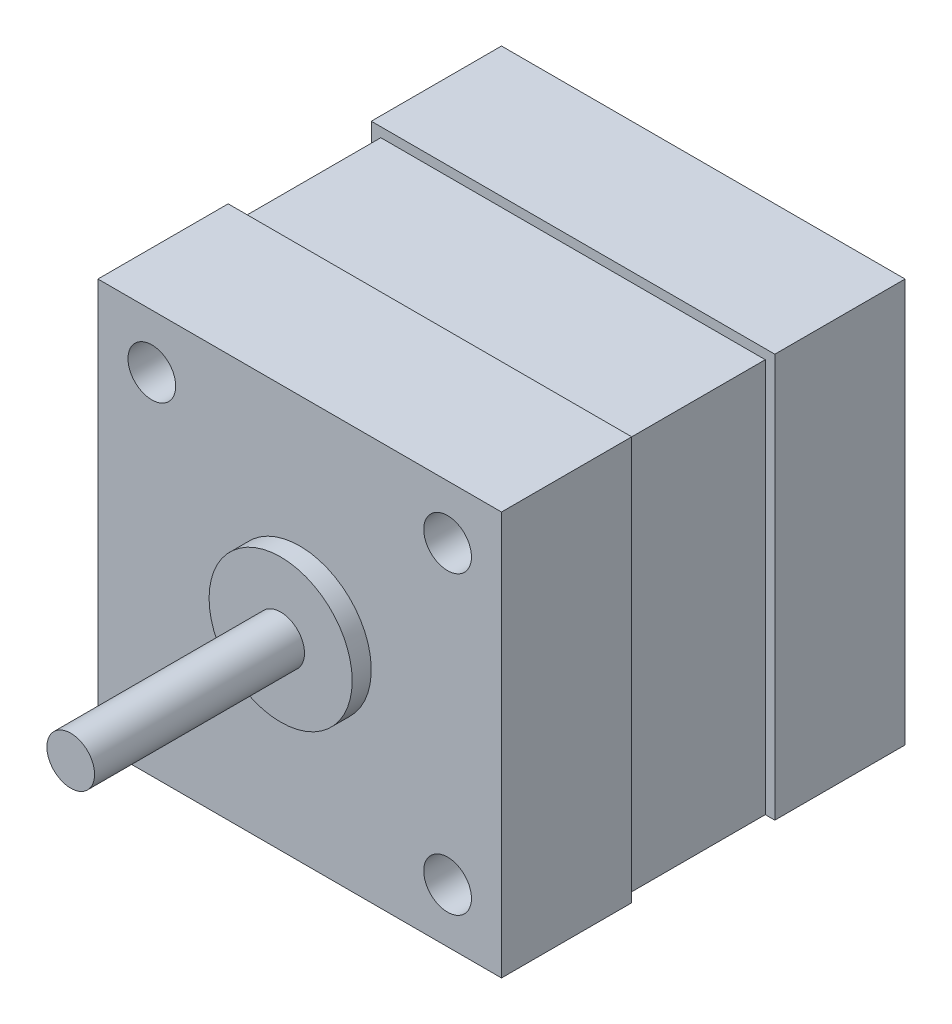
ISO-10303-21;
HEADER;
FILE_DESCRIPTION(('STEP AP214'),'2;1');
FILE_NAME('part.step','',(''),(''),'','','');
FILE_SCHEMA(('AUTOMOTIVE_DESIGN { 1 0 10303 214 1 1 1 1 }'));
ENDSEC;
DATA;
#1=APPLICATION_CONTEXT('core data for automotive mechanical design processes');
#2=APPLICATION_PROTOCOL_DEFINITION('international standard','automotive_design',2000,#1);
#3=PRODUCT_CONTEXT('',#1,'mechanical');
#4=PRODUCT('Part','Part','',(#3));
#5=PRODUCT_RELATED_PRODUCT_CATEGORY('part','',(#4));
#6=PRODUCT_DEFINITION_FORMATION('','',#4);
#7=PRODUCT_DEFINITION_CONTEXT('part definition',#1,'design');
#8=PRODUCT_DEFINITION('design','',#6,#7);
#9=PRODUCT_DEFINITION_SHAPE('','',#8);
#10=(LENGTH_UNIT() NAMED_UNIT(*) SI_UNIT(.MILLI.,.METRE.));
#11=(NAMED_UNIT(*) PLANE_ANGLE_UNIT() SI_UNIT($,.RADIAN.));
#12=(NAMED_UNIT(*) SI_UNIT($,.STERADIAN.) SOLID_ANGLE_UNIT());
#13=UNCERTAINTY_MEASURE_WITH_UNIT(LENGTH_MEASURE(1.E-05),#10,'distance_accuracy_value','');
#14=(GEOMETRIC_REPRESENTATION_CONTEXT(3) GLOBAL_UNCERTAINTY_ASSIGNED_CONTEXT((#13)) GLOBAL_UNIT_ASSIGNED_CONTEXT((#10,
#11,#12)) REPRESENTATION_CONTEXT('',''));
#15=CARTESIAN_POINT('',(0.,0.,0.));
#16=DIRECTION('',(0.,0.,1.));
#17=DIRECTION('',(1.,0.,0.));
#18=AXIS2_PLACEMENT_3D('',#15,#16,#17);
#19=CARTESIAN_POINT('',(-21.15,-21.15,42.3));
#20=DIRECTION('',(1.,0.,0.));
#21=DIRECTION('',(0.,0.,-1.));
#22=AXIS2_PLACEMENT_3D('',#19,#20,#21);
#23=PLANE('',#22);
#24=DIRECTION('',(0.,0.,-1.));
#25=VECTOR('',#24,1.);
#26=CARTESIAN_POINT('',(-21.15,-21.15,42.3));
#27=LINE('',#26,#25);
#28=CARTESIAN_POINT('',(-21.15,-21.15,13.65));
#29=VERTEX_POINT('',#28);
#30=CARTESIAN_POINT('',(-21.15,-21.15,0.));
#31=VERTEX_POINT('',#30);
#32=EDGE_CURVE('E249',#29,#31,#27,.T.);
#33=ORIENTED_EDGE('',*,*,#32,.F.);
#34=DIRECTION('',(0.,1.,0.));
#35=VECTOR('',#34,1.);
#36=CARTESIAN_POINT('',(-21.15,20.15,13.65));
#37=LINE('',#36,#35);
#38=CARTESIAN_POINT('',(-21.15,21.15,13.65));
#39=VERTEX_POINT('',#38);
#40=EDGE_CURVE('E146',#29,#39,#37,.T.);
#41=ORIENTED_EDGE('',*,*,#40,.T.);
#42=DIRECTION('',(0.,0.,-1.));
#43=VECTOR('',#42,1.);
#44=CARTESIAN_POINT('',(-21.15,21.15,42.3));
#45=LINE('',#44,#43);
#46=CARTESIAN_POINT('',(-21.15,21.15,0.));
#47=VERTEX_POINT('',#46);
#48=EDGE_CURVE('E252',#39,#47,#45,.T.);
#49=ORIENTED_EDGE('',*,*,#48,.T.);
#50=DIRECTION('',(0.,-1.,0.));
#51=VECTOR('',#50,1.);
#52=CARTESIAN_POINT('',(-21.15,-21.15,0.));
#53=LINE('',#52,#51);
#54=EDGE_CURVE('E241',#47,#31,#53,.T.);
#55=ORIENTED_EDGE('',*,*,#54,.T.);
#56=EDGE_LOOP('',(#33,#41,#49,#55));
#57=FACE_BOUND('',#56,.T.);
#58=ADVANCED_FACE('F50',(#57),#23,.F.);
#59=DIRECTION('',(0.,1.,0.));
#60=VECTOR('',#59,1.);
#61=CARTESIAN_POINT('',(-21.15,20.15,28.65));
#62=LINE('',#61,#60);
#63=CARTESIAN_POINT('',(-21.15,-21.15,28.65));
#64=VERTEX_POINT('',#63);
#65=CARTESIAN_POINT('',(-21.15,21.15,28.65));
#66=VERTEX_POINT('',#65);
#67=EDGE_CURVE('E168',#64,#66,#62,.T.);
#68=ORIENTED_EDGE('',*,*,#67,.F.);
#69=CARTESIAN_POINT('',(-21.15,-21.15,42.3));
#70=VERTEX_POINT('',#69);
#71=EDGE_CURVE('E250',#70,#64,#27,.T.);
#72=ORIENTED_EDGE('',*,*,#71,.F.);
#73=DIRECTION('',(0.,-1.,0.));
#74=VECTOR('',#73,1.);
#75=CARTESIAN_POINT('',(-21.15,-21.15,42.3));
#76=LINE('',#75,#74);
#77=CARTESIAN_POINT('',(-21.15,21.15,42.3));
#78=VERTEX_POINT('',#77);
#79=EDGE_CURVE('E231',#78,#70,#76,.T.);
#80=ORIENTED_EDGE('',*,*,#79,.F.);
#81=EDGE_CURVE('E253',#78,#66,#45,.T.);
#82=ORIENTED_EDGE('',*,*,#81,.T.);
#83=EDGE_LOOP('',(#68,#72,#80,#82));
#84=FACE_BOUND('',#83,.T.);
#85=ADVANCED_FACE('F301',(#84),#23,.F.);
#86=CARTESIAN_POINT('',(-21.15,-21.15,42.3));
#87=DIRECTION('',(0.,1.,0.));
#88=DIRECTION('',(0.,0.,1.));
#89=AXIS2_PLACEMENT_3D('',#86,#87,#88);
#90=PLANE('',#89);
#91=DIRECTION('',(-1.,0.,0.));
#92=VECTOR('',#91,1.);
#93=CARTESIAN_POINT('',(-20.15,-21.15,13.65));
#94=LINE('',#93,#92);
#95=CARTESIAN_POINT('',(-20.15,-21.15,13.65));
#96=VERTEX_POINT('',#95);
#97=EDGE_CURVE('E139',#96,#29,#94,.T.);
#98=ORIENTED_EDGE('',*,*,#97,.T.);
#99=ORIENTED_EDGE('',*,*,#32,.T.);
#100=DIRECTION('',(1.,0.,0.));
#101=VECTOR('',#100,1.);
#102=CARTESIAN_POINT('',(-21.15,-21.15,0.));
#103=LINE('',#102,#101);
#104=CARTESIAN_POINT('',(21.15,-21.15,0.));
#105=VERTEX_POINT('',#104);
#106=EDGE_CURVE('E229',#31,#105,#103,.T.);
#107=ORIENTED_EDGE('',*,*,#106,.T.);
#108=DIRECTION('',(0.,0.,-1.));
#109=VECTOR('',#108,1.);
#110=CARTESIAN_POINT('',(21.15,-21.15,42.3));
#111=LINE('',#110,#109);
#112=CARTESIAN_POINT('',(21.15,-21.15,13.65));
#113=VERTEX_POINT('',#112);
#114=EDGE_CURVE('E235',#113,#105,#111,.T.);
#115=ORIENTED_EDGE('',*,*,#114,.F.);
#116=DIRECTION('',(1.,0.,0.));
#117=VECTOR('',#116,1.);
#118=CARTESIAN_POINT('',(20.15,-21.15,13.65));
#119=LINE('',#118,#117);
#120=CARTESIAN_POINT('',(20.15,-21.15,13.65));
#121=VERTEX_POINT('',#120);
#122=EDGE_CURVE('E185',#121,#113,#119,.T.);
#123=ORIENTED_EDGE('',*,*,#122,.F.);
#124=DIRECTION('',(0.,0.,-1.));
#125=VECTOR('',#124,1.);
#126=CARTESIAN_POINT('',(20.15,-21.15,28.65));
#127=LINE('',#126,#125);
#128=CARTESIAN_POINT('',(20.15,-21.15,28.65));
#129=VERTEX_POINT('',#128);
#130=EDGE_CURVE('E179',#129,#121,#127,.T.);
#131=ORIENTED_EDGE('',*,*,#130,.F.);
#132=DIRECTION('',(1.,0.,0.));
#133=VECTOR('',#132,1.);
#134=CARTESIAN_POINT('',(20.15,-21.15,28.65));
#135=LINE('',#134,#133);
#136=CARTESIAN_POINT('',(21.15,-21.15,28.65));
#137=VERTEX_POINT('',#136);
#138=EDGE_CURVE('E188',#129,#137,#135,.T.);
#139=ORIENTED_EDGE('',*,*,#138,.T.);
#140=CARTESIAN_POINT('',(21.15,-21.15,42.3));
#141=VERTEX_POINT('',#140);
#142=EDGE_CURVE('E246',#141,#137,#111,.T.);
#143=ORIENTED_EDGE('',*,*,#142,.F.);
#144=DIRECTION('',(1.,0.,0.));
#145=VECTOR('',#144,1.);
#146=CARTESIAN_POINT('',(-21.15,-21.15,42.3));
#147=LINE('',#146,#145);
#148=EDGE_CURVE('E233',#70,#141,#147,.T.);
#149=ORIENTED_EDGE('',*,*,#148,.F.);
#150=ORIENTED_EDGE('',*,*,#71,.T.);
#151=DIRECTION('',(-1.,0.,0.));
#152=VECTOR('',#151,1.);
#153=CARTESIAN_POINT('',(-20.15,-21.15,28.65));
#154=LINE('',#153,#152);
#155=CARTESIAN_POINT('',(-20.15,-21.15,28.65));
#156=VERTEX_POINT('',#155);
#157=EDGE_CURVE('E150',#156,#64,#154,.T.);
#158=ORIENTED_EDGE('',*,*,#157,.F.);
#159=DIRECTION('',(0.,0.,-1.));
#160=VECTOR('',#159,1.);
#161=CARTESIAN_POINT('',(-20.15,-21.15,28.65));
#162=LINE('',#161,#160);
#163=EDGE_CURVE('E153',#156,#96,#162,.T.);
#164=ORIENTED_EDGE('',*,*,#163,.T.);
#165=EDGE_LOOP('',(#98,#99,#107,#115,#123,#131,#139,#143,#149,#150,#158,#164));
#166=FACE_BOUND('',#165,.T.);
#167=ADVANCED_FACE('F156',(#166),#90,.F.);
#168=CARTESIAN_POINT('',(-21.15,21.15,42.3));
#169=DIRECTION('',(0.,-1.,0.));
#170=DIRECTION('',(0.,0.,-1.));
#171=AXIS2_PLACEMENT_3D('',#168,#169,#170);
#172=PLANE('',#171);
#173=DIRECTION('',(1.,0.,0.));
#174=VECTOR('',#173,1.);
#175=CARTESIAN_POINT('',(20.15,21.15,28.65));
#176=LINE('',#175,#174);
#177=CARTESIAN_POINT('',(21.15,21.15,28.65));
#178=VERTEX_POINT('',#177);
#179=EDGE_CURVE('E191',#66,#178,#176,.T.);
#180=ORIENTED_EDGE('',*,*,#179,.F.);
#181=ORIENTED_EDGE('',*,*,#81,.F.);
#182=DIRECTION('',(-1.,0.,0.));
#183=VECTOR('',#182,1.);
#184=CARTESIAN_POINT('',(-21.15,21.15,42.3));
#185=LINE('',#184,#183);
#186=CARTESIAN_POINT('',(21.15,21.15,42.3));
#187=VERTEX_POINT('',#186);
#188=EDGE_CURVE('E228',#187,#78,#185,.T.);
#189=ORIENTED_EDGE('',*,*,#188,.F.);
#190=DIRECTION('',(0.,0.,-1.));
#191=VECTOR('',#190,1.);
#192=CARTESIAN_POINT('',(21.15,21.15,42.3));
#193=LINE('',#192,#191);
#194=EDGE_CURVE('E257',#187,#178,#193,.T.);
#195=ORIENTED_EDGE('',*,*,#194,.T.);
#196=EDGE_LOOP('',(#180,#181,#189,#195));
#197=FACE_BOUND('',#196,.T.);
#198=ADVANCED_FACE('F311',(#197),#172,.F.);
#199=CARTESIAN_POINT('',(20.15,0.,0.));
#200=DIRECTION('',(-1.,0.,0.));
#201=DIRECTION('',(0.,0.,1.));
#202=AXIS2_PLACEMENT_3D('',#199,#200,#201);
#203=PLANE('',#202);
#204=DIRECTION('',(0.,0.,-1.));
#205=VECTOR('',#204,1.);
#206=CARTESIAN_POINT('',(20.15,20.15,13.65));
#207=LINE('',#206,#205);
#208=CARTESIAN_POINT('',(20.15,20.15,28.65));
#209=VERTEX_POINT('',#208);
#210=CARTESIAN_POINT('',(20.15,20.15,13.65));
#211=VERTEX_POINT('',#210);
#212=EDGE_CURVE('E162',#209,#211,#207,.T.);
#213=ORIENTED_EDGE('',*,*,#212,.F.);
#214=DIRECTION('',(0.,-1.,0.));
#215=VECTOR('',#214,1.);
#216=CARTESIAN_POINT('',(20.15,-21.15,28.65));
#217=LINE('',#216,#215);
#218=EDGE_CURVE('E176',#209,#129,#217,.T.);
#219=ORIENTED_EDGE('',*,*,#218,.T.);
#220=ORIENTED_EDGE('',*,*,#130,.T.);
#221=DIRECTION('',(0.,1.,0.));
#222=VECTOR('',#221,1.);
#223=CARTESIAN_POINT('',(20.15,-21.15,13.65));
#224=LINE('',#223,#222);
#225=EDGE_CURVE('E173',#121,#211,#224,.T.);
#226=ORIENTED_EDGE('',*,*,#225,.T.);
#227=EDGE_LOOP('',(#213,#219,#220,#226));
#228=FACE_BOUND('',#227,.T.);
#229=ADVANCED_FACE('F320',(#228),#203,.F.);
#230=CARTESIAN_POINT('',(21.15,-21.15,42.3));
#231=DIRECTION('',(-1.,0.,0.));
#232=DIRECTION('',(0.,0.,1.));
#233=AXIS2_PLACEMENT_3D('',#230,#231,#232);
#234=PLANE('',#233);
#235=CARTESIAN_POINT('',(21.15,21.15,13.65));
#236=VERTEX_POINT('',#235);
#237=CARTESIAN_POINT('',(21.15,21.15,0.));
#238=VERTEX_POINT('',#237);
#239=EDGE_CURVE('E256',#236,#238,#193,.T.);
#240=ORIENTED_EDGE('',*,*,#239,.F.);
#241=DIRECTION('',(0.,1.,0.));
#242=VECTOR('',#241,1.);
#243=CARTESIAN_POINT('',(21.15,-21.15,13.65));
#244=LINE('',#243,#242);
#245=EDGE_CURVE('E171',#113,#236,#244,.T.);
#246=ORIENTED_EDGE('',*,*,#245,.F.);
#247=ORIENTED_EDGE('',*,*,#114,.T.);
#248=DIRECTION('',(0.,1.,0.));
#249=VECTOR('',#248,1.);
#250=CARTESIAN_POINT('',(21.15,-21.15,0.));
#251=LINE('',#250,#249);
#252=EDGE_CURVE('E222',#105,#238,#251,.T.);
#253=ORIENTED_EDGE('',*,*,#252,.T.);
#254=EDGE_LOOP('',(#240,#246,#247,#253));
#255=FACE_BOUND('',#254,.T.);
#256=ADVANCED_FACE('F270',(#255),#234,.F.);
#257=CARTESIAN_POINT('',(0.,0.,42.3));
#258=DIRECTION('',(0.,0.,-1.));
#259=DIRECTION('',(-1.,0.,0.));
#260=AXIS2_PLACEMENT_3D('',#257,#258,#259);
#261=PLANE('',#260);
#262=CARTESIAN_POINT('',(0.,0.,42.3));
#263=DIRECTION('',(0.,0.,-1.));
#264=DIRECTION('',(-1.,0.,0.));
#265=AXIS2_PLACEMENT_3D('',#262,#263,#264);
#266=CIRCLE('',#265,7.5);
#267=CARTESIAN_POINT('',(-7.5,0.,42.3));
#268=VERTEX_POINT('',#267);
#269=EDGE_CURVE('E58',#268,#268,#266,.F.);
#270=ORIENTED_EDGE('',*,*,#269,.F.);
#271=EDGE_LOOP('',(#270));
#272=FACE_BOUND('',#271,.T.);
#273=DIRECTION('',(0.,1.,0.));
#274=VECTOR('',#273,1.);
#275=CARTESIAN_POINT('',(21.15,-21.15,42.3));
#276=LINE('',#275,#274);
#277=EDGE_CURVE('E225',#141,#187,#276,.T.);
#278=ORIENTED_EDGE('',*,*,#277,.T.);
#279=ORIENTED_EDGE('',*,*,#188,.T.);
#280=ORIENTED_EDGE('',*,*,#79,.T.);
#281=ORIENTED_EDGE('',*,*,#148,.T.);
#282=EDGE_LOOP('',(#278,#279,#280,#281));
#283=FACE_BOUND('',#282,.T.);
#284=CARTESIAN_POINT('',(-15.5,15.5,42.3));
#285=DIRECTION('',(0.,0.,1.));
#286=DIRECTION('',(1.,0.,0.));
#287=AXIS2_PLACEMENT_3D('',#284,#285,#286);
#288=CIRCLE('',#287,2.5);
#289=CARTESIAN_POINT('',(-13.,15.5,42.3));
#290=VERTEX_POINT('',#289);
#291=EDGE_CURVE('E219',#290,#290,#288,.T.);
#292=ORIENTED_EDGE('',*,*,#291,.F.);
#293=EDGE_LOOP('',(#292));
#294=FACE_BOUND('',#293,.T.);
#295=CARTESIAN_POINT('',(15.5,15.5,42.3));
#296=DIRECTION('',(0.,0.,1.));
#297=DIRECTION('',(1.,0.,0.));
#298=AXIS2_PLACEMENT_3D('',#295,#296,#297);
#299=CIRCLE('',#298,2.5);
#300=CARTESIAN_POINT('',(18.,15.5,42.3));
#301=VERTEX_POINT('',#300);
#302=EDGE_CURVE('E213',#301,#301,#299,.T.);
#303=ORIENTED_EDGE('',*,*,#302,.F.);
#304=EDGE_LOOP('',(#303));
#305=FACE_BOUND('',#304,.T.);
#306=CARTESIAN_POINT('',(15.5000000000003,-15.5,42.3));
#307=DIRECTION('',(0.,0.,1.));
#308=DIRECTION('',(1.,0.,0.));
#309=AXIS2_PLACEMENT_3D('',#306,#307,#308);
#310=CIRCLE('',#309,2.5);
#311=CARTESIAN_POINT('',(18.0000000000003,-15.5,42.3));
#312=VERTEX_POINT('',#311);
#313=EDGE_CURVE('E207',#312,#312,#310,.T.);
#314=ORIENTED_EDGE('',*,*,#313,.F.);
#315=EDGE_LOOP('',(#314));
#316=FACE_BOUND('',#315,.T.);
#317=CARTESIAN_POINT('',(-15.4999999999997,-15.5,42.3));
#318=DIRECTION('',(0.,0.,1.));
#319=DIRECTION('',(1.,0.,0.));
#320=AXIS2_PLACEMENT_3D('',#317,#318,#319);
#321=CIRCLE('',#320,2.5);
#322=CARTESIAN_POINT('',(-12.9999999999997,-15.5,42.3));
#323=VERTEX_POINT('',#322);
#324=EDGE_CURVE('E201',#323,#323,#321,.T.);
#325=ORIENTED_EDGE('',*,*,#324,.F.);
#326=EDGE_LOOP('',(#325));
#327=FACE_BOUND('',#326,.T.);
#328=ADVANCED_FACE('F266',(#272,#283,#294,#305,#316,#327),#261,.F.);
#329=CARTESIAN_POINT('',(0.,0.,0.));
#330=DIRECTION('',(0.,0.,-1.));
#331=DIRECTION('',(-1.,0.,0.));
#332=AXIS2_PLACEMENT_3D('',#329,#330,#331);
#333=PLANE('',#332);
#334=CARTESIAN_POINT('',(15.5000000000003,-15.5,0.));
#335=DIRECTION('',(0.,0.,1.));
#336=DIRECTION('',(1.,0.,0.));
#337=AXIS2_PLACEMENT_3D('',#334,#335,#336);
#338=CIRCLE('',#337,2.5);
#339=CARTESIAN_POINT('',(18.0000000000003,-15.5,0.));
#340=VERTEX_POINT('',#339);
#341=EDGE_CURVE('E204',#340,#340,#338,.T.);
#342=ORIENTED_EDGE('',*,*,#341,.T.);
#343=EDGE_LOOP('',(#342));
#344=FACE_BOUND('',#343,.T.);
#345=CARTESIAN_POINT('',(-15.5,15.5,0.));
#346=DIRECTION('',(0.,0.,1.));
#347=DIRECTION('',(1.,0.,0.));
#348=AXIS2_PLACEMENT_3D('',#345,#346,#347);
#349=CIRCLE('',#348,2.5);
#350=CARTESIAN_POINT('',(-13.,15.5,0.));
#351=VERTEX_POINT('',#350);
#352=EDGE_CURVE('E216',#351,#351,#349,.T.);
#353=ORIENTED_EDGE('',*,*,#352,.T.);
#354=EDGE_LOOP('',(#353));
#355=FACE_BOUND('',#354,.T.);
#356=ORIENTED_EDGE('',*,*,#252,.F.);
#357=ORIENTED_EDGE('',*,*,#106,.F.);
#358=ORIENTED_EDGE('',*,*,#54,.F.);
#359=DIRECTION('',(-1.,0.,0.));
#360=VECTOR('',#359,1.);
#361=CARTESIAN_POINT('',(-21.15,21.15,0.));
#362=LINE('',#361,#360);
#363=EDGE_CURVE('E238',#238,#47,#362,.T.);
#364=ORIENTED_EDGE('',*,*,#363,.F.);
#365=EDGE_LOOP('',(#356,#357,#358,#364));
#366=FACE_BOUND('',#365,.T.);
#367=CARTESIAN_POINT('',(15.5,15.5,0.));
#368=DIRECTION('',(0.,0.,1.));
#369=DIRECTION('',(1.,0.,0.));
#370=AXIS2_PLACEMENT_3D('',#367,#368,#369);
#371=CIRCLE('',#370,2.5);
#372=CARTESIAN_POINT('',(18.,15.5,0.));
#373=VERTEX_POINT('',#372);
#374=EDGE_CURVE('E210',#373,#373,#371,.T.);
#375=ORIENTED_EDGE('',*,*,#374,.T.);
#376=EDGE_LOOP('',(#375));
#377=FACE_BOUND('',#376,.T.);
#378=CARTESIAN_POINT('',(-15.4999999999997,-15.5,0.));
#379=DIRECTION('',(0.,0.,1.));
#380=DIRECTION('',(1.,0.,0.));
#381=AXIS2_PLACEMENT_3D('',#378,#379,#380);
#382=CIRCLE('',#381,2.5);
#383=CARTESIAN_POINT('',(-12.9999999999997,-15.5,0.));
#384=VERTEX_POINT('',#383);
#385=EDGE_CURVE('E200',#384,#384,#382,.T.);
#386=ORIENTED_EDGE('',*,*,#385,.T.);
#387=EDGE_LOOP('',(#386));
#388=FACE_BOUND('',#387,.T.);
#389=ADVANCED_FACE('F269',(#344,#355,#366,#377,#388),#333,.T.);
#390=ORIENTED_EDGE('',*,*,#142,.T.);
#391=DIRECTION('',(0.,-1.,0.));
#392=VECTOR('',#391,1.);
#393=CARTESIAN_POINT('',(21.15,-21.15,28.65));
#394=LINE('',#393,#392);
#395=EDGE_CURVE('E177',#178,#137,#394,.T.);
#396=ORIENTED_EDGE('',*,*,#395,.F.);
#397=ORIENTED_EDGE('',*,*,#194,.F.);
#398=ORIENTED_EDGE('',*,*,#277,.F.);
#399=EDGE_LOOP('',(#390,#396,#397,#398));
#400=FACE_BOUND('',#399,.T.);
#401=ADVANCED_FACE('F52',(#400),#234,.F.);
#402=ORIENTED_EDGE('',*,*,#48,.F.);
#403=DIRECTION('',(1.,0.,0.));
#404=VECTOR('',#403,1.);
#405=CARTESIAN_POINT('',(20.15,21.15,13.65));
#406=LINE('',#405,#404);
#407=EDGE_CURVE('E182',#39,#236,#406,.T.);
#408=ORIENTED_EDGE('',*,*,#407,.T.);
#409=ORIENTED_EDGE('',*,*,#239,.T.);
#410=ORIENTED_EDGE('',*,*,#363,.T.);
#411=EDGE_LOOP('',(#402,#408,#409,#410));
#412=FACE_BOUND('',#411,.T.);
#413=ADVANCED_FACE('F296',(#412),#172,.F.);
#414=CARTESIAN_POINT('',(-15.5,15.5,42.3));
#415=DIRECTION('',(0.,0.,-1.));
#416=DIRECTION('',(-1.,0.,0.));
#417=AXIS2_PLACEMENT_3D('',#414,#415,#416);
#418=CYLINDRICAL_SURFACE('',#417,2.5);
#419=ORIENTED_EDGE('',*,*,#291,.T.);
#420=EDGE_LOOP('',(#419));
#421=FACE_BOUND('',#420,.T.);
#422=ORIENTED_EDGE('',*,*,#352,.F.);
#423=EDGE_LOOP('',(#422));
#424=FACE_BOUND('',#423,.T.);
#425=ADVANCED_FACE('F309',(#421,#424),#418,.F.);
#426=CARTESIAN_POINT('',(15.5,15.5,42.3));
#427=DIRECTION('',(0.,0.,-1.));
#428=DIRECTION('',(-1.,0.,0.));
#429=AXIS2_PLACEMENT_3D('',#426,#427,#428);
#430=CYLINDRICAL_SURFACE('',#429,2.5);
#431=ORIENTED_EDGE('',*,*,#302,.T.);
#432=EDGE_LOOP('',(#431));
#433=FACE_BOUND('',#432,.T.);
#434=ORIENTED_EDGE('',*,*,#374,.F.);
#435=EDGE_LOOP('',(#434));
#436=FACE_BOUND('',#435,.T.);
#437=ADVANCED_FACE('F315',(#433,#436),#430,.F.);
#438=CARTESIAN_POINT('',(15.5000000000003,-15.5,42.3));
#439=DIRECTION('',(0.,0.,-1.));
#440=DIRECTION('',(-1.,0.,0.));
#441=AXIS2_PLACEMENT_3D('',#438,#439,#440);
#442=CYLINDRICAL_SURFACE('',#441,2.5);
#443=ORIENTED_EDGE('',*,*,#313,.T.);
#444=EDGE_LOOP('',(#443));
#445=FACE_BOUND('',#444,.T.);
#446=ORIENTED_EDGE('',*,*,#341,.F.);
#447=EDGE_LOOP('',(#446));
#448=FACE_BOUND('',#447,.T.);
#449=ADVANCED_FACE('F286',(#445,#448),#442,.F.);
#450=CARTESIAN_POINT('',(-15.4999999999997,-15.5,42.3));
#451=DIRECTION('',(0.,0.,-1.));
#452=DIRECTION('',(-1.,0.,0.));
#453=AXIS2_PLACEMENT_3D('',#450,#451,#452);
#454=CYLINDRICAL_SURFACE('',#453,2.5);
#455=ORIENTED_EDGE('',*,*,#324,.T.);
#456=EDGE_LOOP('',(#455));
#457=FACE_BOUND('',#456,.T.);
#458=ORIENTED_EDGE('',*,*,#385,.F.);
#459=EDGE_LOOP('',(#458));
#460=FACE_BOUND('',#459,.T.);
#461=ADVANCED_FACE('F283',(#457,#460),#454,.F.);
#462=CARTESIAN_POINT('',(0.,0.,44.3));
#463=DIRECTION('',(0.,0.,-1.));
#464=DIRECTION('',(-1.,0.,0.));
#465=AXIS2_PLACEMENT_3D('',#462,#463,#464);
#466=CYLINDRICAL_SURFACE('',#465,7.5);
#467=CARTESIAN_POINT('',(0.,0.,44.3));
#468=DIRECTION('',(0.,0.,1.));
#469=DIRECTION('',(1.,0.,0.));
#470=AXIS2_PLACEMENT_3D('',#467,#468,#469);
#471=CIRCLE('',#470,7.5);
#472=CARTESIAN_POINT('',(7.5,0.,44.3));
#473=VERTEX_POINT('',#472);
#474=EDGE_CURVE('E187',#473,#473,#471,.T.);
#475=ORIENTED_EDGE('',*,*,#474,.F.);
#476=EDGE_LOOP('',(#475));
#477=FACE_BOUND('',#476,.T.);
#478=ORIENTED_EDGE('',*,*,#269,.T.);
#479=EDGE_LOOP('',(#478));
#480=FACE_BOUND('',#479,.T.);
#481=ADVANCED_FACE('F264',(#477,#480),#466,.T.);
#482=CARTESIAN_POINT('',(0.,0.,44.3));
#483=DIRECTION('',(0.,0.,1.));
#484=DIRECTION('',(1.,0.,0.));
#485=AXIS2_PLACEMENT_3D('',#482,#483,#484);
#486=PLANE('',#485);
#487=CARTESIAN_POINT('',(0.,0.,44.3));
#488=DIRECTION('',(0.,0.,1.));
#489=DIRECTION('',(1.,0.,0.));
#490=AXIS2_PLACEMENT_3D('',#487,#488,#489);
#491=CIRCLE('',#490,2.5);
#492=CARTESIAN_POINT('',(2.5,0.,44.3));
#493=VERTEX_POINT('',#492);
#494=EDGE_CURVE('E196',#493,#493,#491,.T.);
#495=ORIENTED_EDGE('',*,*,#494,.F.);
#496=EDGE_LOOP('',(#495));
#497=FACE_BOUND('',#496,.T.);
#498=ORIENTED_EDGE('',*,*,#474,.T.);
#499=EDGE_LOOP('',(#498));
#500=FACE_BOUND('',#499,.T.);
#501=ADVANCED_FACE('F369',(#497,#500),#486,.T.);
#502=CARTESIAN_POINT('',(0.,0.,66.3));
#503=DIRECTION('',(0.,0.,1.));
#504=DIRECTION('',(1.,0.,0.));
#505=AXIS2_PLACEMENT_3D('',#502,#503,#504);
#506=PLANE('',#505);
#507=CARTESIAN_POINT('',(0.,0.,66.3));
#508=DIRECTION('',(0.,0.,1.));
#509=DIRECTION('',(1.,0.,0.));
#510=AXIS2_PLACEMENT_3D('',#507,#508,#509);
#511=CIRCLE('',#510,2.5);
#512=CARTESIAN_POINT('',(2.5,0.,66.3));
#513=VERTEX_POINT('',#512);
#514=EDGE_CURVE('E197',#513,#513,#511,.T.);
#515=ORIENTED_EDGE('',*,*,#514,.T.);
#516=EDGE_LOOP('',(#515));
#517=FACE_BOUND('',#516,.T.);
#518=ADVANCED_FACE('F365',(#517),#506,.T.);
#519=CARTESIAN_POINT('',(0.,0.,66.3));
#520=DIRECTION('',(0.,0.,-1.));
#521=DIRECTION('',(-1.,0.,0.));
#522=AXIS2_PLACEMENT_3D('',#519,#520,#521);
#523=CYLINDRICAL_SURFACE('',#522,2.5);
#524=ORIENTED_EDGE('',*,*,#494,.T.);
#525=EDGE_LOOP('',(#524));
#526=FACE_BOUND('',#525,.T.);
#527=ORIENTED_EDGE('',*,*,#514,.F.);
#528=EDGE_LOOP('',(#527));
#529=FACE_BOUND('',#528,.T.);
#530=ADVANCED_FACE('F362',(#526,#529),#523,.T.);
#531=CARTESIAN_POINT('',(20.15,-21.15,13.65));
#532=DIRECTION('',(0.,0.,-1.));
#533=DIRECTION('',(-1.,0.,0.));
#534=AXIS2_PLACEMENT_3D('',#531,#532,#533);
#535=PLANE('',#534);
#536=ORIENTED_EDGE('',*,*,#245,.T.);
#537=ORIENTED_EDGE('',*,*,#407,.F.);
#538=ORIENTED_EDGE('',*,*,#40,.F.);
#539=ORIENTED_EDGE('',*,*,#97,.F.);
#540=DIRECTION('',(0.,1.,0.));
#541=VECTOR('',#540,1.);
#542=CARTESIAN_POINT('',(-20.15,-21.15,13.65));
#543=LINE('',#542,#541);
#544=CARTESIAN_POINT('',(-20.15,20.15,13.65));
#545=VERTEX_POINT('',#544);
#546=EDGE_CURVE('E143',#96,#545,#543,.T.);
#547=ORIENTED_EDGE('',*,*,#546,.T.);
#548=DIRECTION('',(-1.,0.,0.));
#549=VECTOR('',#548,1.);
#550=CARTESIAN_POINT('',(-21.15,20.15,13.65));
#551=LINE('',#550,#549);
#552=EDGE_CURVE('E165',#211,#545,#551,.T.);
#553=ORIENTED_EDGE('',*,*,#552,.F.);
#554=ORIENTED_EDGE('',*,*,#225,.F.);
#555=ORIENTED_EDGE('',*,*,#122,.T.);
#556=EDGE_LOOP('',(#536,#537,#538,#539,#547,#553,#554,#555));
#557=FACE_BOUND('',#556,.T.);
#558=ADVANCED_FACE('F142',(#557),#535,.F.);
#559=CARTESIAN_POINT('',(20.15,-21.15,28.65));
#560=DIRECTION('',(0.,0.,1.));
#561=DIRECTION('',(1.,0.,0.));
#562=AXIS2_PLACEMENT_3D('',#559,#560,#561);
#563=PLANE('',#562);
#564=DIRECTION('',(1.,0.,0.));
#565=VECTOR('',#564,1.);
#566=CARTESIAN_POINT('',(-21.15,20.15,28.65));
#567=LINE('',#566,#565);
#568=CARTESIAN_POINT('',(-20.15,20.15,28.65));
#569=VERTEX_POINT('',#568);
#570=EDGE_CURVE('E71',#569,#209,#567,.T.);
#571=ORIENTED_EDGE('',*,*,#570,.F.);
#572=DIRECTION('',(0.,-1.,0.));
#573=VECTOR('',#572,1.);
#574=CARTESIAN_POINT('',(-20.15,-21.15,28.65));
#575=LINE('',#574,#573);
#576=EDGE_CURVE('E64',#569,#156,#575,.T.);
#577=ORIENTED_EDGE('',*,*,#576,.T.);
#578=ORIENTED_EDGE('',*,*,#157,.T.);
#579=ORIENTED_EDGE('',*,*,#67,.T.);
#580=ORIENTED_EDGE('',*,*,#179,.T.);
#581=ORIENTED_EDGE('',*,*,#395,.T.);
#582=ORIENTED_EDGE('',*,*,#138,.F.);
#583=ORIENTED_EDGE('',*,*,#218,.F.);
#584=EDGE_LOOP('',(#571,#577,#578,#579,#580,#581,#582,#583));
#585=FACE_BOUND('',#584,.T.);
#586=ADVANCED_FACE('F332',(#585),#563,.F.);
#587=CARTESIAN_POINT('',(0.,20.15,0.));
#588=DIRECTION('',(0.,1.,0.));
#589=DIRECTION('',(0.,0.,1.));
#590=AXIS2_PLACEMENT_3D('',#587,#588,#589);
#591=PLANE('',#590);
#592=DIRECTION('',(0.,0.,-1.));
#593=VECTOR('',#592,1.);
#594=CARTESIAN_POINT('',(-20.15,20.15,0.));
#595=LINE('',#594,#593);
#596=EDGE_CURVE('E13',#569,#545,#595,.T.);
#597=ORIENTED_EDGE('',*,*,#596,.F.);
#598=ORIENTED_EDGE('',*,*,#570,.T.);
#599=ORIENTED_EDGE('',*,*,#212,.T.);
#600=ORIENTED_EDGE('',*,*,#552,.T.);
#601=EDGE_LOOP('',(#597,#598,#599,#600));
#602=FACE_BOUND('',#601,.T.);
#603=ADVANCED_FACE('F341',(#602),#591,.T.);
#604=CARTESIAN_POINT('',(-20.15,0.,0.));
#605=DIRECTION('',(1.,0.,0.));
#606=DIRECTION('',(0.,0.,1.));
#607=AXIS2_PLACEMENT_3D('',#604,#605,#606);
#608=PLANE('',#607);
#609=ORIENTED_EDGE('',*,*,#596,.T.);
#610=ORIENTED_EDGE('',*,*,#546,.F.);
#611=ORIENTED_EDGE('',*,*,#163,.F.);
#612=ORIENTED_EDGE('',*,*,#576,.F.);
#613=EDGE_LOOP('',(#609,#610,#611,#612));
#614=FACE_BOUND('',#613,.T.);
#615=ADVANCED_FACE('F152',(#614),#608,.F.);
#616=CLOSED_SHELL('',(#58,#85,#167,#198,#229,#256,#328,#389,#401,#413,#425,#437,#449,#461,#481,
#501,#518,#530,#558,#586,#603,#615));
#617=MANIFOLD_SOLID_BREP('B2',#616);
#618=ADVANCED_BREP_SHAPE_REPRESENTATION('',(#18,#617),#14);
#619=SHAPE_DEFINITION_REPRESENTATION(#9,#618);
ENDSEC;
END-ISO-10303-21;
